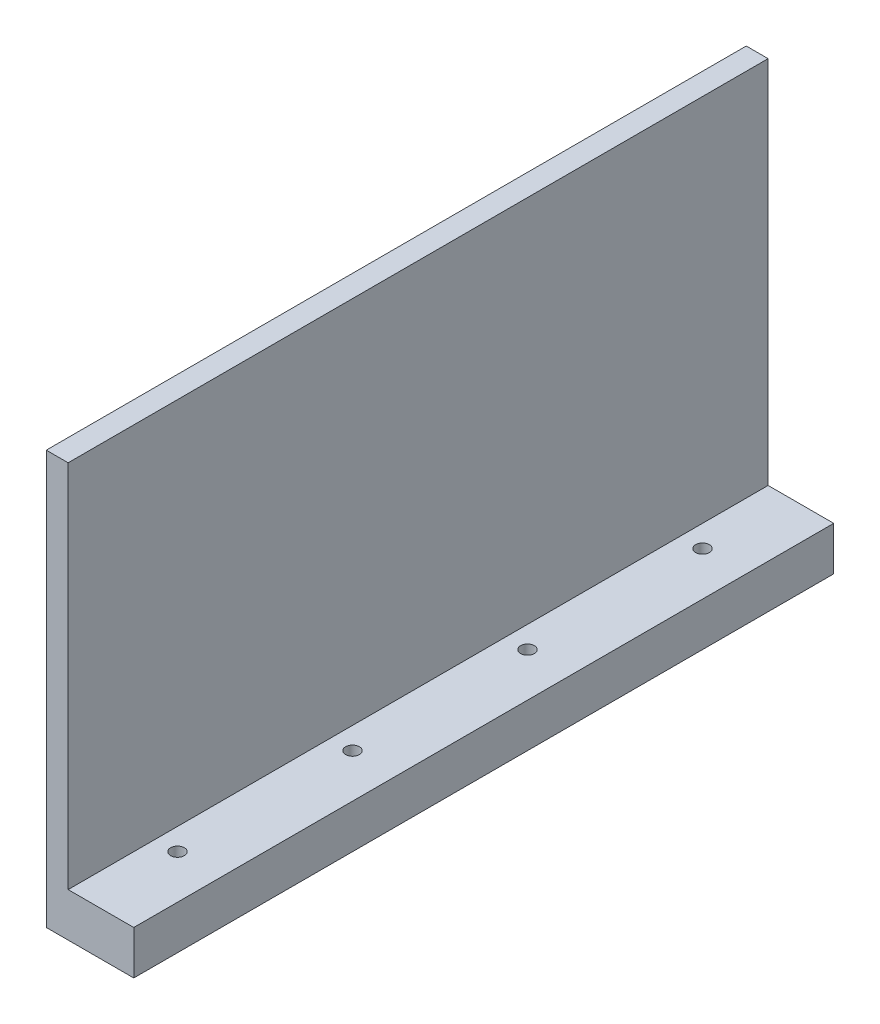
ISO-10303-21;
HEADER;
FILE_DESCRIPTION(('STEP AP214'),'2;1');
FILE_NAME('part.step','',(''),(''),'','','');
FILE_SCHEMA(('AUTOMOTIVE_DESIGN { 1 0 10303 214 1 1 1 1 }'));
ENDSEC;
DATA;
#1=APPLICATION_CONTEXT('core data for automotive mechanical design processes');
#2=APPLICATION_PROTOCOL_DEFINITION('international standard','automotive_design',2000,#1);
#3=PRODUCT_CONTEXT('',#1,'mechanical');
#4=PRODUCT('Part','Part','',(#3));
#5=PRODUCT_RELATED_PRODUCT_CATEGORY('part','',(#4));
#6=PRODUCT_DEFINITION_FORMATION('','',#4);
#7=PRODUCT_DEFINITION_CONTEXT('part definition',#1,'design');
#8=PRODUCT_DEFINITION('design','',#6,#7);
#9=PRODUCT_DEFINITION_SHAPE('','',#8);
#10=(LENGTH_UNIT() NAMED_UNIT(*) SI_UNIT(.MILLI.,.METRE.));
#11=(NAMED_UNIT(*) PLANE_ANGLE_UNIT() SI_UNIT($,.RADIAN.));
#12=(NAMED_UNIT(*) SI_UNIT($,.STERADIAN.) SOLID_ANGLE_UNIT());
#13=UNCERTAINTY_MEASURE_WITH_UNIT(LENGTH_MEASURE(1.E-05),#10,'distance_accuracy_value','');
#14=(GEOMETRIC_REPRESENTATION_CONTEXT(3) GLOBAL_UNCERTAINTY_ASSIGNED_CONTEXT((#13)) GLOBAL_UNIT_ASSIGNED_CONTEXT((#10,
#11,#12)) REPRESENTATION_CONTEXT('',''));
#15=CARTESIAN_POINT('',(0.,0.,0.));
#16=DIRECTION('',(0.,0.,1.));
#17=DIRECTION('',(1.,0.,0.));
#18=AXIS2_PLACEMENT_3D('',#15,#16,#17);
#19=CARTESIAN_POINT('',(6.35,59.999999888,50.8));
#20=DIRECTION('',(-1.,0.,0.));
#21=DIRECTION('',(0.,0.,1.));
#22=AXIS2_PLACEMENT_3D('',#19,#20,#21);
#23=PLANE('',#22);
#24=DIRECTION('',(0.,-1.,0.));
#25=VECTOR('',#24,1.);
#26=CARTESIAN_POINT('',(6.35,59.999999888,-50.8));
#27=LINE('',#26,#25);
#28=CARTESIAN_POINT('',(6.35,6.34999999999999,-50.8));
#29=VERTEX_POINT('',#28);
#30=CARTESIAN_POINT('',(6.35,0.,-50.8));
#31=VERTEX_POINT('',#30);
#32=EDGE_CURVE('E12',#29,#31,#27,.T.);
#33=ORIENTED_EDGE('',*,*,#32,.F.);
#34=DIRECTION('',(0.,0.,-1.));
#35=VECTOR('',#34,1.);
#36=CARTESIAN_POINT('',(6.35,6.34999999999999,-50.8));
#37=LINE('',#36,#35);
#38=CARTESIAN_POINT('',(6.35000000000001,6.34999999999999,50.8));
#39=VERTEX_POINT('',#38);
#40=EDGE_CURVE('E95',#39,#29,#37,.T.);
#41=ORIENTED_EDGE('',*,*,#40,.F.);
#42=DIRECTION('',(0.,-1.,0.));
#43=VECTOR('',#42,1.);
#44=CARTESIAN_POINT('',(6.35,59.999999888,50.8));
#45=LINE('',#44,#43);
#46=CARTESIAN_POINT('',(6.35,0.,50.8));
#47=VERTEX_POINT('',#46);
#48=EDGE_CURVE('E88',#39,#47,#45,.T.);
#49=ORIENTED_EDGE('',*,*,#48,.T.);
#50=DIRECTION('',(0.,0.,-1.));
#51=VECTOR('',#50,1.);
#52=CARTESIAN_POINT('',(6.35,0.,50.8));
#53=LINE('',#52,#51);
#54=EDGE_CURVE('E92',#47,#31,#53,.T.);
#55=ORIENTED_EDGE('',*,*,#54,.T.);
#56=EDGE_LOOP('',(#33,#41,#49,#55));
#57=FACE_BOUND('',#56,.T.);
#58=ADVANCED_FACE('F45',(#57),#23,.F.);
#59=CARTESIAN_POINT('',(-6.35,59.999999888,-50.8));
#60=DIRECTION('',(0.,0.,1.));
#61=DIRECTION('',(1.,0.,0.));
#62=AXIS2_PLACEMENT_3D('',#59,#60,#61);
#63=PLANE('',#62);
#64=DIRECTION('',(0.,1.,0.));
#65=VECTOR('',#64,1.);
#66=CARTESIAN_POINT('',(-3.175,-102.045507617925,-50.8));
#67=LINE('',#66,#65);
#68=CARTESIAN_POINT('',(-3.175,6.34999999999999,-50.8));
#69=VERTEX_POINT('',#68);
#70=CARTESIAN_POINT('',(-3.17499999999999,59.999999888,-50.8));
#71=VERTEX_POINT('',#70);
#72=EDGE_CURVE('E60',#69,#71,#67,.T.);
#73=ORIENTED_EDGE('',*,*,#72,.F.);
#74=DIRECTION('',(-1.,0.,0.));
#75=VECTOR('',#74,1.);
#76=CARTESIAN_POINT('',(6.35,6.34999999999999,-50.8));
#77=LINE('',#76,#75);
#78=EDGE_CURVE('E140',#29,#69,#77,.T.);
#79=ORIENTED_EDGE('',*,*,#78,.F.);
#80=ORIENTED_EDGE('',*,*,#32,.T.);
#81=DIRECTION('',(-1.,0.,0.));
#82=VECTOR('',#81,1.);
#83=CARTESIAN_POINT('',(-6.35,0.,-50.8));
#84=LINE('',#83,#82);
#85=CARTESIAN_POINT('',(-6.35,0.,-50.8));
#86=VERTEX_POINT('',#85);
#87=EDGE_CURVE('E115',#31,#86,#84,.T.);
#88=ORIENTED_EDGE('',*,*,#87,.T.);
#89=DIRECTION('',(0.,-1.,0.));
#90=VECTOR('',#89,1.);
#91=CARTESIAN_POINT('',(-6.35,59.999999888,-50.8));
#92=LINE('',#91,#90);
#93=CARTESIAN_POINT('',(-6.35,59.999999888,-50.8));
#94=VERTEX_POINT('',#93);
#95=EDGE_CURVE('E53',#94,#86,#92,.T.);
#96=ORIENTED_EDGE('',*,*,#95,.F.);
#97=DIRECTION('',(-1.,0.,0.));
#98=VECTOR('',#97,1.);
#99=CARTESIAN_POINT('',(-6.35,59.999999888,-50.8));
#100=LINE('',#99,#98);
#101=EDGE_CURVE('E110',#71,#94,#100,.T.);
#102=ORIENTED_EDGE('',*,*,#101,.F.);
#103=EDGE_LOOP('',(#73,#79,#80,#88,#96,#102));
#104=FACE_BOUND('',#103,.T.);
#105=ADVANCED_FACE('F136',(#104),#63,.F.);
#106=CARTESIAN_POINT('',(-6.35,59.999999888,50.8));
#107=DIRECTION('',(1.,0.,0.));
#108=DIRECTION('',(0.,0.,-1.));
#109=AXIS2_PLACEMENT_3D('',#106,#107,#108);
#110=PLANE('',#109);
#111=DIRECTION('',(0.,0.,1.));
#112=VECTOR('',#111,1.);
#113=CARTESIAN_POINT('',(-6.35,0.,50.8));
#114=LINE('',#113,#112);
#115=CARTESIAN_POINT('',(-6.35,0.,50.8));
#116=VERTEX_POINT('',#115);
#117=EDGE_CURVE('E111',#86,#116,#114,.T.);
#118=ORIENTED_EDGE('',*,*,#117,.T.);
#119=DIRECTION('',(0.,-1.,0.));
#120=VECTOR('',#119,1.);
#121=CARTESIAN_POINT('',(-6.35,59.999999888,50.8));
#122=LINE('',#121,#120);
#123=CARTESIAN_POINT('',(-6.35,59.999999888,50.8));
#124=VERTEX_POINT('',#123);
#125=EDGE_CURVE('E99',#124,#116,#122,.T.);
#126=ORIENTED_EDGE('',*,*,#125,.F.);
#127=DIRECTION('',(0.,0.,1.));
#128=VECTOR('',#127,1.);
#129=CARTESIAN_POINT('',(-6.35,59.999999888,50.8));
#130=LINE('',#129,#128);
#131=EDGE_CURVE('E69',#94,#124,#130,.T.);
#132=ORIENTED_EDGE('',*,*,#131,.F.);
#133=ORIENTED_EDGE('',*,*,#95,.T.);
#134=EDGE_LOOP('',(#118,#126,#132,#133));
#135=FACE_BOUND('',#134,.T.);
#136=ADVANCED_FACE('F133',(#135),#110,.F.);
#137=CARTESIAN_POINT('',(-6.35,59.999999888,50.8));
#138=DIRECTION('',(0.,0.,-1.));
#139=DIRECTION('',(-1.,0.,0.));
#140=AXIS2_PLACEMENT_3D('',#137,#138,#139);
#141=PLANE('',#140);
#142=ORIENTED_EDGE('',*,*,#48,.F.);
#143=DIRECTION('',(1.,0.,0.));
#144=VECTOR('',#143,1.);
#145=CARTESIAN_POINT('',(6.35000000000001,6.34999999999999,50.8));
#146=LINE('',#145,#144);
#147=CARTESIAN_POINT('',(-3.17499999999999,6.34999999999999,50.8));
#148=VERTEX_POINT('',#147);
#149=EDGE_CURVE('E121',#148,#39,#146,.T.);
#150=ORIENTED_EDGE('',*,*,#149,.F.);
#151=DIRECTION('',(0.,1.,0.));
#152=VECTOR('',#151,1.);
#153=CARTESIAN_POINT('',(-3.17499999999999,-102.045507617925,50.8));
#154=LINE('',#153,#152);
#155=CARTESIAN_POINT('',(-3.17499999999999,59.999999888,50.8));
#156=VERTEX_POINT('',#155);
#157=EDGE_CURVE('E155',#148,#156,#154,.T.);
#158=ORIENTED_EDGE('',*,*,#157,.T.);
#159=DIRECTION('',(1.,0.,0.));
#160=VECTOR('',#159,1.);
#161=CARTESIAN_POINT('',(-6.35,59.999999888,50.8));
#162=LINE('',#161,#160);
#163=EDGE_CURVE('E100',#124,#156,#162,.T.);
#164=ORIENTED_EDGE('',*,*,#163,.F.);
#165=ORIENTED_EDGE('',*,*,#125,.T.);
#166=DIRECTION('',(1.,0.,0.));
#167=VECTOR('',#166,1.);
#168=CARTESIAN_POINT('',(-6.35,0.,50.8));
#169=LINE('',#168,#167);
#170=EDGE_CURVE('E104',#116,#47,#169,.T.);
#171=ORIENTED_EDGE('',*,*,#170,.T.);
#172=EDGE_LOOP('',(#142,#150,#158,#164,#165,#171));
#173=FACE_BOUND('',#172,.T.);
#174=ADVANCED_FACE('F105',(#173),#141,.F.);
#175=CARTESIAN_POINT('',(0.,59.999999888,0.));
#176=DIRECTION('',(0.,-1.,0.));
#177=DIRECTION('',(0.,0.,-1.));
#178=AXIS2_PLACEMENT_3D('',#175,#176,#177);
#179=PLANE('',#178);
#180=ORIENTED_EDGE('',*,*,#163,.T.);
#181=DIRECTION('',(0.,0.,1.));
#182=VECTOR('',#181,1.);
#183=CARTESIAN_POINT('',(-3.175,59.999999888,-50.8));
#184=LINE('',#183,#182);
#185=EDGE_CURVE('E169',#71,#156,#184,.T.);
#186=ORIENTED_EDGE('',*,*,#185,.F.);
#187=ORIENTED_EDGE('',*,*,#101,.T.);
#188=ORIENTED_EDGE('',*,*,#131,.T.);
#189=EDGE_LOOP('',(#180,#186,#187,#188));
#190=FACE_BOUND('',#189,.T.);
#191=ADVANCED_FACE('F168',(#190),#179,.F.);
#192=CARTESIAN_POINT('',(0.,0.,0.));
#193=DIRECTION('',(0.,-1.,0.));
#194=DIRECTION('',(0.,0.,-1.));
#195=AXIS2_PLACEMENT_3D('',#192,#193,#194);
#196=PLANE('',#195);
#197=CARTESIAN_POINT('',(-5.2899115316986E-13,0.,-38.1));
#198=DIRECTION('',(0.,1.,0.));
#199=DIRECTION('',(0.,0.,1.));
#200=AXIS2_PLACEMENT_3D('',#197,#198,#199);
#201=CIRCLE('',#200,1.00000003199999);
#202=CARTESIAN_POINT('',(-5.2899115316986E-13,0.,-37.099999968));
#203=VERTEX_POINT('',#202);
#204=EDGE_CURVE('E172',#203,#203,#201,.T.);
#205=ORIENTED_EDGE('',*,*,#204,.T.);
#206=EDGE_LOOP('',(#205));
#207=FACE_BOUND('',#206,.T.);
#208=CARTESIAN_POINT('',(-2.6449557658493E-13,0.,-12.7));
#209=DIRECTION('',(0.,1.,0.));
#210=DIRECTION('',(0.,0.,1.));
#211=AXIS2_PLACEMENT_3D('',#208,#209,#210);
#212=CIRCLE('',#211,1.00000003199999);
#213=CARTESIAN_POINT('',(-2.6449557658493E-13,0.,-11.699999968));
#214=VERTEX_POINT('',#213);
#215=EDGE_CURVE('E196',#214,#214,#212,.T.);
#216=ORIENTED_EDGE('',*,*,#215,.T.);
#217=EDGE_LOOP('',(#216));
#218=FACE_BOUND('',#217,.T.);
#219=CARTESIAN_POINT('',(0.,0.,12.7));
#220=DIRECTION('',(0.,1.,0.));
#221=DIRECTION('',(0.,0.,1.));
#222=AXIS2_PLACEMENT_3D('',#219,#220,#221);
#223=CIRCLE('',#222,1.000000032);
#224=CARTESIAN_POINT('',(0.,0.,13.700000032));
#225=VERTEX_POINT('',#224);
#226=EDGE_CURVE('E188',#225,#225,#223,.T.);
#227=ORIENTED_EDGE('',*,*,#226,.T.);
#228=EDGE_LOOP('',(#227));
#229=FACE_BOUND('',#228,.T.);
#230=CARTESIAN_POINT('',(2.64495576584929E-13,0.,38.1));
#231=DIRECTION('',(0.,1.,0.));
#232=DIRECTION('',(0.,0.,1.));
#233=AXIS2_PLACEMENT_3D('',#230,#231,#232);
#234=CIRCLE('',#233,1.00000003199999);
#235=CARTESIAN_POINT('',(2.64495576584929E-13,0.,39.100000032));
#236=VERTEX_POINT('',#235);
#237=EDGE_CURVE('E180',#236,#236,#234,.T.);
#238=ORIENTED_EDGE('',*,*,#237,.T.);
#239=EDGE_LOOP('',(#238));
#240=FACE_BOUND('',#239,.T.);
#241=ORIENTED_EDGE('',*,*,#54,.F.);
#242=ORIENTED_EDGE('',*,*,#170,.F.);
#243=ORIENTED_EDGE('',*,*,#117,.F.);
#244=ORIENTED_EDGE('',*,*,#87,.F.);
#245=EDGE_LOOP('',(#241,#242,#243,#244));
#246=FACE_BOUND('',#245,.T.);
#247=ADVANCED_FACE('F114',(#207,#218,#229,#240,#246),#196,.T.);
#248=CARTESIAN_POINT('',(0.,6.35,0.));
#249=DIRECTION('',(0.,-1.,0.));
#250=DIRECTION('',(0.,0.,-1.));
#251=AXIS2_PLACEMENT_3D('',#248,#249,#250);
#252=PLANE('',#251);
#253=CARTESIAN_POINT('',(-5.2899115316986E-13,6.35,-38.1));
#254=DIRECTION('',(0.,1.,0.));
#255=DIRECTION('',(0.,0.,1.));
#256=AXIS2_PLACEMENT_3D('',#253,#254,#255);
#257=CIRCLE('',#256,1.00000003199999);
#258=CARTESIAN_POINT('',(-5.2899115316986E-13,6.35,-37.099999968));
#259=VERTEX_POINT('',#258);
#260=EDGE_CURVE('E177',#259,#259,#257,.T.);
#261=ORIENTED_EDGE('',*,*,#260,.F.);
#262=EDGE_LOOP('',(#261));
#263=FACE_BOUND('',#262,.T.);
#264=CARTESIAN_POINT('',(-2.6449557658493E-13,6.35,-12.7));
#265=DIRECTION('',(0.,1.,0.));
#266=DIRECTION('',(0.,0.,1.));
#267=AXIS2_PLACEMENT_3D('',#264,#265,#266);
#268=CIRCLE('',#267,1.00000003199999);
#269=CARTESIAN_POINT('',(-2.6449557658493E-13,6.35,-11.699999968));
#270=VERTEX_POINT('',#269);
#271=EDGE_CURVE('E200',#270,#270,#268,.T.);
#272=ORIENTED_EDGE('',*,*,#271,.F.);
#273=EDGE_LOOP('',(#272));
#274=FACE_BOUND('',#273,.T.);
#275=CARTESIAN_POINT('',(0.,6.35,12.7));
#276=DIRECTION('',(0.,1.,0.));
#277=DIRECTION('',(0.,0.,1.));
#278=AXIS2_PLACEMENT_3D('',#275,#276,#277);
#279=CIRCLE('',#278,1.000000032);
#280=CARTESIAN_POINT('',(0.,6.35,13.700000032));
#281=VERTEX_POINT('',#280);
#282=EDGE_CURVE('E192',#281,#281,#279,.T.);
#283=ORIENTED_EDGE('',*,*,#282,.F.);
#284=EDGE_LOOP('',(#283));
#285=FACE_BOUND('',#284,.T.);
#286=CARTESIAN_POINT('',(2.64495576584929E-13,6.35,38.1));
#287=DIRECTION('',(0.,1.,0.));
#288=DIRECTION('',(0.,0.,1.));
#289=AXIS2_PLACEMENT_3D('',#286,#287,#288);
#290=CIRCLE('',#289,1.00000003199999);
#291=CARTESIAN_POINT('',(2.64495576584929E-13,6.35,39.100000032));
#292=VERTEX_POINT('',#291);
#293=EDGE_CURVE('E184',#292,#292,#290,.T.);
#294=ORIENTED_EDGE('',*,*,#293,.F.);
#295=EDGE_LOOP('',(#294));
#296=FACE_BOUND('',#295,.T.);
#297=ORIENTED_EDGE('',*,*,#40,.T.);
#298=ORIENTED_EDGE('',*,*,#78,.T.);
#299=DIRECTION('',(0.,0.,1.));
#300=VECTOR('',#299,1.);
#301=CARTESIAN_POINT('',(-3.175,6.34999999999999,-50.8));
#302=LINE('',#301,#300);
#303=EDGE_CURVE('E152',#69,#148,#302,.T.);
#304=ORIENTED_EDGE('',*,*,#303,.T.);
#305=ORIENTED_EDGE('',*,*,#149,.T.);
#306=EDGE_LOOP('',(#297,#298,#304,#305));
#307=FACE_BOUND('',#306,.T.);
#308=ADVANCED_FACE('F151',(#263,#274,#285,#296,#307),#252,.F.);
#309=CARTESIAN_POINT('',(-3.175,-102.045507617925,-50.8));
#310=DIRECTION('',(-1.,0.,0.));
#311=DIRECTION('',(0.,0.,1.));
#312=AXIS2_PLACEMENT_3D('',#309,#310,#311);
#313=PLANE('',#312);
#314=ORIENTED_EDGE('',*,*,#72,.T.);
#315=ORIENTED_EDGE('',*,*,#185,.T.);
#316=ORIENTED_EDGE('',*,*,#157,.F.);
#317=ORIENTED_EDGE('',*,*,#303,.F.);
#318=EDGE_LOOP('',(#314,#315,#316,#317));
#319=FACE_BOUND('',#318,.T.);
#320=ADVANCED_FACE('F170',(#319),#313,.F.);
#321=CARTESIAN_POINT('',(2.64495576584929E-13,0.,38.1));
#322=DIRECTION('',(0.,1.,0.));
#323=DIRECTION('',(0.,0.,1.));
#324=AXIS2_PLACEMENT_3D('',#321,#322,#323);
#325=CYLINDRICAL_SURFACE('',#324,1.00000003199999);
#326=ORIENTED_EDGE('',*,*,#237,.F.);
#327=EDGE_LOOP('',(#326));
#328=FACE_BOUND('',#327,.T.);
#329=ORIENTED_EDGE('',*,*,#293,.T.);
#330=EDGE_LOOP('',(#329));
#331=FACE_BOUND('',#330,.T.);
#332=ADVANCED_FACE('F219',(#328,#331),#325,.F.);
#333=CARTESIAN_POINT('',(0.,0.,12.7));
#334=DIRECTION('',(0.,1.,0.));
#335=DIRECTION('',(0.,0.,1.));
#336=AXIS2_PLACEMENT_3D('',#333,#334,#335);
#337=CYLINDRICAL_SURFACE('',#336,1.000000032);
#338=ORIENTED_EDGE('',*,*,#226,.F.);
#339=EDGE_LOOP('',(#338));
#340=FACE_BOUND('',#339,.T.);
#341=ORIENTED_EDGE('',*,*,#282,.T.);
#342=EDGE_LOOP('',(#341));
#343=FACE_BOUND('',#342,.T.);
#344=ADVANCED_FACE('F221',(#340,#343),#337,.F.);
#345=CARTESIAN_POINT('',(-2.6449557658493E-13,0.,-12.7));
#346=DIRECTION('',(0.,1.,0.));
#347=DIRECTION('',(0.,0.,1.));
#348=AXIS2_PLACEMENT_3D('',#345,#346,#347);
#349=CYLINDRICAL_SURFACE('',#348,1.00000003199999);
#350=ORIENTED_EDGE('',*,*,#215,.F.);
#351=EDGE_LOOP('',(#350));
#352=FACE_BOUND('',#351,.T.);
#353=ORIENTED_EDGE('',*,*,#271,.T.);
#354=EDGE_LOOP('',(#353));
#355=FACE_BOUND('',#354,.T.);
#356=ADVANCED_FACE('F228',(#352,#355),#349,.F.);
#357=CARTESIAN_POINT('',(-5.2899115316986E-13,0.,-38.1));
#358=DIRECTION('',(0.,1.,0.));
#359=DIRECTION('',(0.,0.,1.));
#360=AXIS2_PLACEMENT_3D('',#357,#358,#359);
#361=CYLINDRICAL_SURFACE('',#360,1.00000003199999);
#362=ORIENTED_EDGE('',*,*,#204,.F.);
#363=EDGE_LOOP('',(#362));
#364=FACE_BOUND('',#363,.T.);
#365=ORIENTED_EDGE('',*,*,#260,.T.);
#366=EDGE_LOOP('',(#365));
#367=FACE_BOUND('',#366,.T.);
#368=ADVANCED_FACE('F208',(#364,#367),#361,.F.);
#369=CLOSED_SHELL('',(#58,#105,#136,#174,#191,#247,#308,#320,#332,#344,#356,#368));
#370=MANIFOLD_SOLID_BREP('B2',#369);
#371=ADVANCED_BREP_SHAPE_REPRESENTATION('',(#18,#370),#14);
#372=SHAPE_DEFINITION_REPRESENTATION(#9,#371);
ENDSEC;
END-ISO-10303-21;
